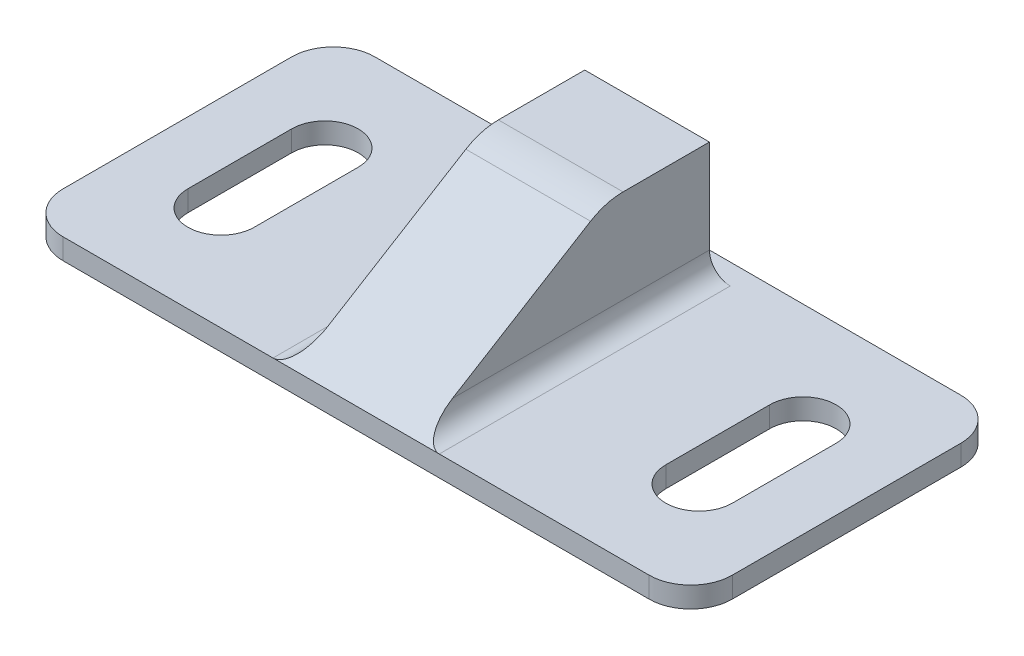
ISO-10303-21;
HEADER;
FILE_DESCRIPTION(('STEP AP214'),'2;1');
FILE_NAME('part.step','',(''),(''),'','','');
FILE_SCHEMA(('AUTOMOTIVE_DESIGN { 1 0 10303 214 1 1 1 1 }'));
ENDSEC;
DATA;
#1=APPLICATION_CONTEXT('core data for automotive mechanical design processes');
#2=APPLICATION_PROTOCOL_DEFINITION('international standard','automotive_design',2000,#1);
#3=PRODUCT_CONTEXT('',#1,'mechanical');
#4=PRODUCT('Part','Part','',(#3));
#5=PRODUCT_RELATED_PRODUCT_CATEGORY('part','',(#4));
#6=PRODUCT_DEFINITION_FORMATION('','',#4);
#7=PRODUCT_DEFINITION_CONTEXT('part definition',#1,'design');
#8=PRODUCT_DEFINITION('design','',#6,#7);
#9=PRODUCT_DEFINITION_SHAPE('','',#8);
#10=(LENGTH_UNIT() NAMED_UNIT(*) SI_UNIT(.MILLI.,.METRE.));
#11=(NAMED_UNIT(*) PLANE_ANGLE_UNIT() SI_UNIT($,.RADIAN.));
#12=(NAMED_UNIT(*) SI_UNIT($,.STERADIAN.) SOLID_ANGLE_UNIT());
#13=UNCERTAINTY_MEASURE_WITH_UNIT(LENGTH_MEASURE(1.E-05),#10,'distance_accuracy_value','');
#14=(GEOMETRIC_REPRESENTATION_CONTEXT(3) GLOBAL_UNCERTAINTY_ASSIGNED_CONTEXT((#13)) GLOBAL_UNIT_ASSIGNED_CONTEXT((#10,
#11,#12)) REPRESENTATION_CONTEXT('',''));
#15=CARTESIAN_POINT('',(0.,0.,0.));
#16=DIRECTION('',(0.,0.,1.));
#17=DIRECTION('',(1.,0.,0.));
#18=AXIS2_PLACEMENT_3D('',#15,#16,#17);
#19=CARTESIAN_POINT('',(-14.1,1.,-5.5));
#20=DIRECTION('',(0.,-1.,0.));
#21=DIRECTION('',(0.,0.,-1.));
#22=AXIS2_PLACEMENT_3D('',#19,#20,#21);
#23=PLANE('',#22);
#24=CARTESIAN_POINT('',(-11.5,1.,2.49999999999999));
#25=DIRECTION('',(0.,1.,0.));
#26=DIRECTION('',(0.,0.,-1.));
#27=AXIS2_PLACEMENT_3D('',#24,#25,#26);
#28=CIRCLE('',#27,1.6);
#29=CARTESIAN_POINT('',(-13.1,1.,2.49999999999999));
#30=VERTEX_POINT('',#29);
#31=CARTESIAN_POINT('',(-9.9,1.,2.49999999999999));
#32=VERTEX_POINT('',#31);
#33=EDGE_CURVE('E231',#30,#32,#28,.T.);
#34=ORIENTED_EDGE('',*,*,#33,.F.);
#35=DIRECTION('',(0.,0.,1.));
#36=VECTOR('',#35,1.);
#37=CARTESIAN_POINT('',(-13.1,1.,2.49999999999999));
#38=LINE('',#37,#36);
#39=CARTESIAN_POINT('',(-13.1,1.,-2.5));
#40=VERTEX_POINT('',#39);
#41=EDGE_CURVE('E239',#40,#30,#38,.T.);
#42=ORIENTED_EDGE('',*,*,#41,.F.);
#43=CARTESIAN_POINT('',(-11.5,1.,-2.5));
#44=DIRECTION('',(0.,1.,0.));
#45=DIRECTION('',(0.,0.,-1.));
#46=AXIS2_PLACEMENT_3D('',#43,#44,#45);
#47=CIRCLE('',#46,1.6);
#48=CARTESIAN_POINT('',(-9.9,1.,-2.5));
#49=VERTEX_POINT('',#48);
#50=EDGE_CURVE('E236',#49,#40,#47,.T.);
#51=ORIENTED_EDGE('',*,*,#50,.F.);
#52=DIRECTION('',(0.,0.,-1.));
#53=VECTOR('',#52,1.);
#54=CARTESIAN_POINT('',(-9.9,1.,2.49999999999999));
#55=LINE('',#54,#53);
#56=EDGE_CURVE('E233',#32,#49,#55,.T.);
#57=ORIENTED_EDGE('',*,*,#56,.F.);
#58=EDGE_LOOP('',(#34,#42,#51,#57));
#59=FACE_BOUND('',#58,.T.);
#60=CARTESIAN_POINT('',(11.5,1.,2.5));
#61=DIRECTION('',(0.,1.,0.));
#62=DIRECTION('',(0.,0.,1.));
#63=AXIS2_PLACEMENT_3D('',#60,#61,#62);
#64=CIRCLE('',#63,1.6);
#65=CARTESIAN_POINT('',(9.9,1.,2.5));
#66=VERTEX_POINT('',#65);
#67=CARTESIAN_POINT('',(13.1,1.,2.5));
#68=VERTEX_POINT('',#67);
#69=EDGE_CURVE('E262',#66,#68,#64,.T.);
#70=ORIENTED_EDGE('',*,*,#69,.F.);
#71=DIRECTION('',(0.,0.,1.));
#72=VECTOR('',#71,1.);
#73=CARTESIAN_POINT('',(9.9,1.,2.5));
#74=LINE('',#73,#72);
#75=CARTESIAN_POINT('',(9.9,1.,-2.5));
#76=VERTEX_POINT('',#75);
#77=EDGE_CURVE('E270',#76,#66,#74,.T.);
#78=ORIENTED_EDGE('',*,*,#77,.F.);
#79=CARTESIAN_POINT('',(11.5,1.,-2.5));
#80=DIRECTION('',(0.,1.,0.));
#81=DIRECTION('',(0.,0.,1.));
#82=AXIS2_PLACEMENT_3D('',#79,#80,#81);
#83=CIRCLE('',#82,1.6);
#84=CARTESIAN_POINT('',(13.1,1.,-2.5));
#85=VERTEX_POINT('',#84);
#86=EDGE_CURVE('E267',#85,#76,#83,.T.);
#87=ORIENTED_EDGE('',*,*,#86,.F.);
#88=DIRECTION('',(0.,0.,-1.));
#89=VECTOR('',#88,1.);
#90=CARTESIAN_POINT('',(13.1,1.,2.5));
#91=LINE('',#90,#89);
#92=EDGE_CURVE('E264',#68,#85,#91,.T.);
#93=ORIENTED_EDGE('',*,*,#92,.F.);
#94=EDGE_LOOP('',(#70,#78,#87,#93));
#95=FACE_BOUND('',#94,.T.);
#96=DIRECTION('',(1.,0.,0.));
#97=VECTOR('',#96,1.);
#98=CARTESIAN_POINT('',(-14.1,1.,7.5));
#99=LINE('',#98,#97);
#100=CARTESIAN_POINT('',(-14.1,1.,7.5));
#101=VERTEX_POINT('',#100);
#102=CARTESIAN_POINT('',(-4.,1.,7.5));
#103=VERTEX_POINT('',#102);
#104=EDGE_CURVE('E302',#101,#103,#99,.T.);
#105=ORIENTED_EDGE('',*,*,#104,.T.);
#106=DIRECTION('',(0.,0.,-1.));
#107=VECTOR('',#106,1.);
#108=CARTESIAN_POINT('',(-4.,1.,-6.5));
#109=LINE('',#108,#107);
#110=CARTESIAN_POINT('',(-4.,1.,-6.5));
#111=VERTEX_POINT('',#110);
#112=EDGE_CURVE('E354',#103,#111,#109,.T.);
#113=ORIENTED_EDGE('',*,*,#112,.T.);
#114=DIRECTION('',(1.,0.,0.));
#115=VECTOR('',#114,1.);
#116=CARTESIAN_POINT('',(-3.,1.,-6.5));
#117=LINE('',#116,#115);
#118=CARTESIAN_POINT('',(4.,1.,-6.5));
#119=VERTEX_POINT('',#118);
#120=EDGE_CURVE('E208',#111,#119,#117,.T.);
#121=ORIENTED_EDGE('',*,*,#120,.T.);
#122=DIRECTION('',(0.,0.,-1.));
#123=VECTOR('',#122,1.);
#124=CARTESIAN_POINT('',(4.,1.,-5.5));
#125=LINE('',#124,#123);
#126=CARTESIAN_POINT('',(4.,1.,7.5));
#127=VERTEX_POINT('',#126);
#128=EDGE_CURVE('E351',#119,#127,#125,.F.);
#129=ORIENTED_EDGE('',*,*,#128,.T.);
#130=CARTESIAN_POINT('',(14.1,1.,7.5));
#131=VERTEX_POINT('',#130);
#132=EDGE_CURVE('E301',#127,#131,#99,.T.);
#133=ORIENTED_EDGE('',*,*,#132,.T.);
#134=CARTESIAN_POINT('',(14.1,1.,5.5));
#135=DIRECTION('',(0.,1.,0.));
#136=DIRECTION('',(0.,0.,1.));
#137=AXIS2_PLACEMENT_3D('',#134,#135,#136);
#138=CIRCLE('',#137,2.);
#139=CARTESIAN_POINT('',(16.1,1.,5.5));
#140=VERTEX_POINT('',#139);
#141=EDGE_CURVE('E304',#131,#140,#138,.T.);
#142=ORIENTED_EDGE('',*,*,#141,.T.);
#143=DIRECTION('',(0.,0.,-1.));
#144=VECTOR('',#143,1.);
#145=CARTESIAN_POINT('',(16.1,1.,5.5));
#146=LINE('',#145,#144);
#147=CARTESIAN_POINT('',(16.1,1.,-5.5));
#148=VERTEX_POINT('',#147);
#149=EDGE_CURVE('E306',#140,#148,#146,.T.);
#150=ORIENTED_EDGE('',*,*,#149,.T.);
#151=CARTESIAN_POINT('',(14.1,1.,-5.5));
#152=DIRECTION('',(0.,1.,0.));
#153=DIRECTION('',(0.,0.,-1.));
#154=AXIS2_PLACEMENT_3D('',#151,#152,#153);
#155=CIRCLE('',#154,2.);
#156=CARTESIAN_POINT('',(14.1,1.,-7.5));
#157=VERTEX_POINT('',#156);
#158=EDGE_CURVE('E308',#148,#157,#155,.T.);
#159=ORIENTED_EDGE('',*,*,#158,.T.);
#160=DIRECTION('',(-1.,0.,0.));
#161=VECTOR('',#160,1.);
#162=CARTESIAN_POINT('',(-14.1,1.,-7.5));
#163=LINE('',#162,#161);
#164=CARTESIAN_POINT('',(-14.1,1.,-7.5));
#165=VERTEX_POINT('',#164);
#166=EDGE_CURVE('E310',#157,#165,#163,.T.);
#167=ORIENTED_EDGE('',*,*,#166,.T.);
#168=CARTESIAN_POINT('',(-14.1,1.,-5.5));
#169=DIRECTION('',(0.,1.,0.));
#170=DIRECTION('',(0.,0.,-1.));
#171=AXIS2_PLACEMENT_3D('',#168,#169,#170);
#172=CIRCLE('',#171,2.);
#173=CARTESIAN_POINT('',(-16.1,1.,-5.5));
#174=VERTEX_POINT('',#173);
#175=EDGE_CURVE('E293',#165,#174,#172,.T.);
#176=ORIENTED_EDGE('',*,*,#175,.T.);
#177=DIRECTION('',(0.,0.,1.));
#178=VECTOR('',#177,1.);
#179=CARTESIAN_POINT('',(-16.1,1.,5.5));
#180=LINE('',#179,#178);
#181=CARTESIAN_POINT('',(-16.1,1.,5.5));
#182=VERTEX_POINT('',#181);
#183=EDGE_CURVE('E296',#174,#182,#180,.T.);
#184=ORIENTED_EDGE('',*,*,#183,.T.);
#185=CARTESIAN_POINT('',(-14.1,1.,5.5));
#186=DIRECTION('',(0.,1.,0.));
#187=DIRECTION('',(0.,0.,-1.));
#188=AXIS2_PLACEMENT_3D('',#185,#186,#187);
#189=CIRCLE('',#188,2.);
#190=EDGE_CURVE('E299',#182,#101,#189,.T.);
#191=ORIENTED_EDGE('',*,*,#190,.T.);
#192=EDGE_LOOP('',(#105,#113,#121,#129,#133,#142,#150,#159,#167,#176,#184,#191));
#193=FACE_BOUND('',#192,.T.);
#194=ADVANCED_FACE('F33',(#59,#95,#193),#23,.F.);
#195=CARTESIAN_POINT('',(-14.1,0.,-5.5));
#196=DIRECTION('',(0.,-1.,0.));
#197=DIRECTION('',(0.,0.,-1.));
#198=AXIS2_PLACEMENT_3D('',#195,#196,#197);
#199=PLANE('',#198);
#200=CARTESIAN_POINT('',(-14.1,0.,-5.5));
#201=DIRECTION('',(0.,1.,0.));
#202=DIRECTION('',(0.,0.,-1.));
#203=AXIS2_PLACEMENT_3D('',#200,#201,#202);
#204=CIRCLE('',#203,2.);
#205=CARTESIAN_POINT('',(-14.1,0.,-7.5));
#206=VERTEX_POINT('',#205);
#207=CARTESIAN_POINT('',(-16.1,0.,-5.5));
#208=VERTEX_POINT('',#207);
#209=EDGE_CURVE('E292',#206,#208,#204,.T.);
#210=ORIENTED_EDGE('',*,*,#209,.F.);
#211=DIRECTION('',(-1.,0.,0.));
#212=VECTOR('',#211,1.);
#213=CARTESIAN_POINT('',(-14.1,0.,-7.5));
#214=LINE('',#213,#212);
#215=CARTESIAN_POINT('',(14.1,0.,-7.5));
#216=VERTEX_POINT('',#215);
#217=EDGE_CURVE('E297',#216,#206,#214,.T.);
#218=ORIENTED_EDGE('',*,*,#217,.F.);
#219=CARTESIAN_POINT('',(14.1,0.,-5.5));
#220=DIRECTION('',(0.,1.,0.));
#221=DIRECTION('',(0.,0.,-1.));
#222=AXIS2_PLACEMENT_3D('',#219,#220,#221);
#223=CIRCLE('',#222,2.);
#224=CARTESIAN_POINT('',(16.1,0.,-5.5));
#225=VERTEX_POINT('',#224);
#226=EDGE_CURVE('E325',#225,#216,#223,.T.);
#227=ORIENTED_EDGE('',*,*,#226,.F.);
#228=DIRECTION('',(0.,0.,-1.));
#229=VECTOR('',#228,1.);
#230=CARTESIAN_POINT('',(16.1,0.,5.5));
#231=LINE('',#230,#229);
#232=CARTESIAN_POINT('',(16.1,0.,5.5));
#233=VERTEX_POINT('',#232);
#234=EDGE_CURVE('E323',#233,#225,#231,.T.);
#235=ORIENTED_EDGE('',*,*,#234,.F.);
#236=CARTESIAN_POINT('',(14.1,0.,5.5));
#237=DIRECTION('',(0.,1.,0.));
#238=DIRECTION('',(0.,0.,1.));
#239=AXIS2_PLACEMENT_3D('',#236,#237,#238);
#240=CIRCLE('',#239,2.);
#241=CARTESIAN_POINT('',(14.1,0.,7.5));
#242=VERTEX_POINT('',#241);
#243=EDGE_CURVE('E321',#242,#233,#240,.T.);
#244=ORIENTED_EDGE('',*,*,#243,.F.);
#245=DIRECTION('',(1.,0.,0.));
#246=VECTOR('',#245,1.);
#247=CARTESIAN_POINT('',(-14.1,0.,7.5));
#248=LINE('',#247,#246);
#249=CARTESIAN_POINT('',(-14.1,0.,7.5));
#250=VERTEX_POINT('',#249);
#251=EDGE_CURVE('E319',#250,#242,#248,.T.);
#252=ORIENTED_EDGE('',*,*,#251,.F.);
#253=CARTESIAN_POINT('',(-14.1,0.,5.5));
#254=DIRECTION('',(0.,1.,0.));
#255=DIRECTION('',(0.,0.,-1.));
#256=AXIS2_PLACEMENT_3D('',#253,#254,#255);
#257=CIRCLE('',#256,2.);
#258=CARTESIAN_POINT('',(-16.1,0.,5.5));
#259=VERTEX_POINT('',#258);
#260=EDGE_CURVE('E317',#259,#250,#257,.T.);
#261=ORIENTED_EDGE('',*,*,#260,.F.);
#262=DIRECTION('',(0.,0.,1.));
#263=VECTOR('',#262,1.);
#264=CARTESIAN_POINT('',(-16.1,0.,5.5));
#265=LINE('',#264,#263);
#266=EDGE_CURVE('E315',#208,#259,#265,.T.);
#267=ORIENTED_EDGE('',*,*,#266,.F.);
#268=EDGE_LOOP('',(#210,#218,#227,#235,#244,#252,#261,#267));
#269=FACE_BOUND('',#268,.T.);
#270=DIRECTION('',(0.,0.,1.));
#271=VECTOR('',#270,1.);
#272=CARTESIAN_POINT('',(9.9,0.,2.5));
#273=LINE('',#272,#271);
#274=CARTESIAN_POINT('',(9.9,0.,-2.5));
#275=VERTEX_POINT('',#274);
#276=CARTESIAN_POINT('',(9.9,0.,2.5));
#277=VERTEX_POINT('',#276);
#278=EDGE_CURVE('E265',#275,#277,#273,.T.);
#279=ORIENTED_EDGE('',*,*,#278,.T.);
#280=CARTESIAN_POINT('',(11.5,0.,2.5));
#281=DIRECTION('',(0.,1.,0.));
#282=DIRECTION('',(0.,0.,1.));
#283=AXIS2_PLACEMENT_3D('',#280,#281,#282);
#284=CIRCLE('',#283,1.6);
#285=CARTESIAN_POINT('',(13.1,0.,2.5));
#286=VERTEX_POINT('',#285);
#287=EDGE_CURVE('E261',#277,#286,#284,.T.);
#288=ORIENTED_EDGE('',*,*,#287,.T.);
#289=DIRECTION('',(0.,0.,-1.));
#290=VECTOR('',#289,1.);
#291=CARTESIAN_POINT('',(13.1,0.,2.5));
#292=LINE('',#291,#290);
#293=CARTESIAN_POINT('',(13.1,0.,-2.5));
#294=VERTEX_POINT('',#293);
#295=EDGE_CURVE('E275',#286,#294,#292,.T.);
#296=ORIENTED_EDGE('',*,*,#295,.T.);
#297=CARTESIAN_POINT('',(11.5,0.,-2.5));
#298=DIRECTION('',(0.,1.,0.));
#299=DIRECTION('',(0.,0.,1.));
#300=AXIS2_PLACEMENT_3D('',#297,#298,#299);
#301=CIRCLE('',#300,1.6);
#302=EDGE_CURVE('E278',#294,#275,#301,.T.);
#303=ORIENTED_EDGE('',*,*,#302,.T.);
#304=EDGE_LOOP('',(#279,#288,#296,#303));
#305=FACE_BOUND('',#304,.T.);
#306=DIRECTION('',(0.,0.,1.));
#307=VECTOR('',#306,1.);
#308=CARTESIAN_POINT('',(-13.1,0.,2.49999999999999));
#309=LINE('',#308,#307);
#310=CARTESIAN_POINT('',(-13.1,0.,-2.5));
#311=VERTEX_POINT('',#310);
#312=CARTESIAN_POINT('',(-13.1,0.,2.49999999999999));
#313=VERTEX_POINT('',#312);
#314=EDGE_CURVE('E234',#311,#313,#309,.T.);
#315=ORIENTED_EDGE('',*,*,#314,.T.);
#316=CARTESIAN_POINT('',(-11.5,0.,2.49999999999999));
#317=DIRECTION('',(0.,1.,0.));
#318=DIRECTION('',(0.,0.,-1.));
#319=AXIS2_PLACEMENT_3D('',#316,#317,#318);
#320=CIRCLE('',#319,1.6);
#321=CARTESIAN_POINT('',(-9.9,0.,2.49999999999999));
#322=VERTEX_POINT('',#321);
#323=EDGE_CURVE('E227',#313,#322,#320,.T.);
#324=ORIENTED_EDGE('',*,*,#323,.T.);
#325=DIRECTION('',(0.,0.,-1.));
#326=VECTOR('',#325,1.);
#327=CARTESIAN_POINT('',(-9.9,0.,2.49999999999999));
#328=LINE('',#327,#326);
#329=CARTESIAN_POINT('',(-9.9,0.,-2.5));
#330=VERTEX_POINT('',#329);
#331=EDGE_CURVE('E244',#322,#330,#328,.T.);
#332=ORIENTED_EDGE('',*,*,#331,.T.);
#333=CARTESIAN_POINT('',(-11.5,0.,-2.5));
#334=DIRECTION('',(0.,1.,0.));
#335=DIRECTION('',(0.,0.,-1.));
#336=AXIS2_PLACEMENT_3D('',#333,#334,#335);
#337=CIRCLE('',#336,1.6);
#338=EDGE_CURVE('E247',#330,#311,#337,.T.);
#339=ORIENTED_EDGE('',*,*,#338,.T.);
#340=EDGE_LOOP('',(#315,#324,#332,#339));
#341=FACE_BOUND('',#340,.T.);
#342=ADVANCED_FACE('F430',(#269,#305,#341),#199,.T.);
#343=CARTESIAN_POINT('',(-14.1,1.,-5.5));
#344=DIRECTION('',(0.,-1.,0.));
#345=DIRECTION('',(0.,0.,-1.));
#346=AXIS2_PLACEMENT_3D('',#343,#344,#345);
#347=CYLINDRICAL_SURFACE('',#346,2.);
#348=ORIENTED_EDGE('',*,*,#209,.T.);
#349=DIRECTION('',(0.,-1.,0.));
#350=VECTOR('',#349,1.);
#351=CARTESIAN_POINT('',(-16.1,1.,-5.5));
#352=LINE('',#351,#350);
#353=EDGE_CURVE('E348',#174,#208,#352,.T.);
#354=ORIENTED_EDGE('',*,*,#353,.F.);
#355=ORIENTED_EDGE('',*,*,#175,.F.);
#356=DIRECTION('',(0.,-1.,0.));
#357=VECTOR('',#356,1.);
#358=CARTESIAN_POINT('',(-14.1,1.,-7.5));
#359=LINE('',#358,#357);
#360=EDGE_CURVE('E312',#165,#206,#359,.T.);
#361=ORIENTED_EDGE('',*,*,#360,.T.);
#362=EDGE_LOOP('',(#348,#354,#355,#361));
#363=FACE_BOUND('',#362,.T.);
#364=ADVANCED_FACE('F396',(#363),#347,.T.);
#365=CARTESIAN_POINT('',(-16.1,1.,5.5));
#366=DIRECTION('',(1.,0.,0.));
#367=DIRECTION('',(0.,0.,-1.));
#368=AXIS2_PLACEMENT_3D('',#365,#366,#367);
#369=PLANE('',#368);
#370=ORIENTED_EDGE('',*,*,#266,.T.);
#371=DIRECTION('',(0.,-1.,0.));
#372=VECTOR('',#371,1.);
#373=CARTESIAN_POINT('',(-16.1,1.,5.5));
#374=LINE('',#373,#372);
#375=EDGE_CURVE('E345',#182,#259,#374,.T.);
#376=ORIENTED_EDGE('',*,*,#375,.F.);
#377=ORIENTED_EDGE('',*,*,#183,.F.);
#378=ORIENTED_EDGE('',*,*,#353,.T.);
#379=EDGE_LOOP('',(#370,#376,#377,#378));
#380=FACE_BOUND('',#379,.T.);
#381=ADVANCED_FACE('F399',(#380),#369,.F.);
#382=CARTESIAN_POINT('',(-14.1,1.,5.5));
#383=DIRECTION('',(0.,-1.,0.));
#384=DIRECTION('',(0.,0.,-1.));
#385=AXIS2_PLACEMENT_3D('',#382,#383,#384);
#386=CYLINDRICAL_SURFACE('',#385,2.);
#387=ORIENTED_EDGE('',*,*,#260,.T.);
#388=DIRECTION('',(0.,-1.,0.));
#389=VECTOR('',#388,1.);
#390=CARTESIAN_POINT('',(-14.1,1.,7.5));
#391=LINE('',#390,#389);
#392=EDGE_CURVE('E342',#101,#250,#391,.T.);
#393=ORIENTED_EDGE('',*,*,#392,.F.);
#394=ORIENTED_EDGE('',*,*,#190,.F.);
#395=ORIENTED_EDGE('',*,*,#375,.T.);
#396=EDGE_LOOP('',(#387,#393,#394,#395));
#397=FACE_BOUND('',#396,.T.);
#398=ADVANCED_FACE('F404',(#397),#386,.T.);
#399=CARTESIAN_POINT('',(-14.1,1.,7.5));
#400=DIRECTION('',(0.,0.,-1.));
#401=DIRECTION('',(-1.,0.,0.));
#402=AXIS2_PLACEMENT_3D('',#399,#400,#401);
#403=PLANE('',#402);
#404=ORIENTED_EDGE('',*,*,#251,.T.);
#405=DIRECTION('',(0.,-1.,0.));
#406=VECTOR('',#405,1.);
#407=CARTESIAN_POINT('',(14.1,1.,7.5));
#408=LINE('',#407,#406);
#409=EDGE_CURVE('E339',#131,#242,#408,.T.);
#410=ORIENTED_EDGE('',*,*,#409,.F.);
#411=ORIENTED_EDGE('',*,*,#132,.F.);
#412=DIRECTION('',(1.,0.,0.));
#413=VECTOR('',#412,1.);
#414=CARTESIAN_POINT('',(-3.,1.,7.5));
#415=LINE('',#414,#413);
#416=EDGE_CURVE('E49',#103,#127,#415,.T.);
#417=ORIENTED_EDGE('',*,*,#416,.F.);
#418=ORIENTED_EDGE('',*,*,#104,.F.);
#419=ORIENTED_EDGE('',*,*,#392,.T.);
#420=EDGE_LOOP('',(#404,#410,#411,#417,#418,#419));
#421=FACE_BOUND('',#420,.T.);
#422=ADVANCED_FACE('F370',(#421),#403,.F.);
#423=CARTESIAN_POINT('',(14.1,1.,5.5));
#424=DIRECTION('',(0.,-1.,0.));
#425=DIRECTION('',(0.,0.,-1.));
#426=AXIS2_PLACEMENT_3D('',#423,#424,#425);
#427=CYLINDRICAL_SURFACE('',#426,2.);
#428=ORIENTED_EDGE('',*,*,#243,.T.);
#429=DIRECTION('',(0.,-1.,0.));
#430=VECTOR('',#429,1.);
#431=CARTESIAN_POINT('',(16.1,1.,5.5));
#432=LINE('',#431,#430);
#433=EDGE_CURVE('E336',#140,#233,#432,.T.);
#434=ORIENTED_EDGE('',*,*,#433,.F.);
#435=ORIENTED_EDGE('',*,*,#141,.F.);
#436=ORIENTED_EDGE('',*,*,#409,.T.);
#437=EDGE_LOOP('',(#428,#434,#435,#436));
#438=FACE_BOUND('',#437,.T.);
#439=ADVANCED_FACE('F376',(#438),#427,.T.);
#440=CARTESIAN_POINT('',(16.1,1.,5.5));
#441=DIRECTION('',(-1.,0.,0.));
#442=DIRECTION('',(0.,0.,1.));
#443=AXIS2_PLACEMENT_3D('',#440,#441,#442);
#444=PLANE('',#443);
#445=ORIENTED_EDGE('',*,*,#234,.T.);
#446=DIRECTION('',(0.,-1.,0.));
#447=VECTOR('',#446,1.);
#448=CARTESIAN_POINT('',(16.1,1.,-5.5));
#449=LINE('',#448,#447);
#450=EDGE_CURVE('E333',#148,#225,#449,.T.);
#451=ORIENTED_EDGE('',*,*,#450,.F.);
#452=ORIENTED_EDGE('',*,*,#149,.F.);
#453=ORIENTED_EDGE('',*,*,#433,.T.);
#454=EDGE_LOOP('',(#445,#451,#452,#453));
#455=FACE_BOUND('',#454,.T.);
#456=ADVANCED_FACE('F382',(#455),#444,.F.);
#457=CARTESIAN_POINT('',(14.1,1.,-5.5));
#458=DIRECTION('',(0.,-1.,0.));
#459=DIRECTION('',(0.,0.,-1.));
#460=AXIS2_PLACEMENT_3D('',#457,#458,#459);
#461=CYLINDRICAL_SURFACE('',#460,2.);
#462=ORIENTED_EDGE('',*,*,#226,.T.);
#463=DIRECTION('',(0.,-1.,0.));
#464=VECTOR('',#463,1.);
#465=CARTESIAN_POINT('',(14.1,1.,-7.5));
#466=LINE('',#465,#464);
#467=EDGE_CURVE('E330',#157,#216,#466,.T.);
#468=ORIENTED_EDGE('',*,*,#467,.F.);
#469=ORIENTED_EDGE('',*,*,#158,.F.);
#470=ORIENTED_EDGE('',*,*,#450,.T.);
#471=EDGE_LOOP('',(#462,#468,#469,#470));
#472=FACE_BOUND('',#471,.T.);
#473=ADVANCED_FACE('F386',(#472),#461,.T.);
#474=CARTESIAN_POINT('',(-14.1,1.,-7.5));
#475=DIRECTION('',(0.,0.,1.));
#476=DIRECTION('',(1.,0.,0.));
#477=AXIS2_PLACEMENT_3D('',#474,#475,#476);
#478=PLANE('',#477);
#479=ORIENTED_EDGE('',*,*,#217,.T.);
#480=ORIENTED_EDGE('',*,*,#360,.F.);
#481=ORIENTED_EDGE('',*,*,#166,.F.);
#482=ORIENTED_EDGE('',*,*,#467,.T.);
#483=EDGE_LOOP('',(#479,#480,#481,#482));
#484=FACE_BOUND('',#483,.T.);
#485=ADVANCED_FACE('F391',(#484),#478,.F.);
#486=CARTESIAN_POINT('',(11.5,1.,2.5));
#487=DIRECTION('',(0.,-1.,0.));
#488=DIRECTION('',(0.,0.,-1.));
#489=AXIS2_PLACEMENT_3D('',#486,#487,#488);
#490=CYLINDRICAL_SURFACE('',#489,1.6);
#491=ORIENTED_EDGE('',*,*,#287,.F.);
#492=DIRECTION('',(0.,-1.,0.));
#493=VECTOR('',#492,1.);
#494=CARTESIAN_POINT('',(9.9,1.,2.5));
#495=LINE('',#494,#493);
#496=EDGE_CURVE('E272',#66,#277,#495,.T.);
#497=ORIENTED_EDGE('',*,*,#496,.F.);
#498=ORIENTED_EDGE('',*,*,#69,.T.);
#499=DIRECTION('',(0.,-1.,0.));
#500=VECTOR('',#499,1.);
#501=CARTESIAN_POINT('',(13.1,1.,2.5));
#502=LINE('',#501,#500);
#503=EDGE_CURVE('E289',#68,#286,#502,.T.);
#504=ORIENTED_EDGE('',*,*,#503,.T.);
#505=EDGE_LOOP('',(#491,#497,#498,#504));
#506=FACE_BOUND('',#505,.T.);
#507=ADVANCED_FACE('F441',(#506),#490,.F.);
#508=CARTESIAN_POINT('',(13.1,1.,2.5));
#509=DIRECTION('',(-1.,0.,0.));
#510=DIRECTION('',(0.,0.,1.));
#511=AXIS2_PLACEMENT_3D('',#508,#509,#510);
#512=PLANE('',#511);
#513=ORIENTED_EDGE('',*,*,#295,.F.);
#514=ORIENTED_EDGE('',*,*,#503,.F.);
#515=ORIENTED_EDGE('',*,*,#92,.T.);
#516=DIRECTION('',(0.,-1.,0.));
#517=VECTOR('',#516,1.);
#518=CARTESIAN_POINT('',(13.1,1.,-2.5));
#519=LINE('',#518,#517);
#520=EDGE_CURVE('E287',#85,#294,#519,.T.);
#521=ORIENTED_EDGE('',*,*,#520,.T.);
#522=EDGE_LOOP('',(#513,#514,#515,#521));
#523=FACE_BOUND('',#522,.T.);
#524=ADVANCED_FACE('F496',(#523),#512,.T.);
#525=CARTESIAN_POINT('',(11.5,1.,-2.5));
#526=DIRECTION('',(0.,-1.,0.));
#527=DIRECTION('',(0.,0.,-1.));
#528=AXIS2_PLACEMENT_3D('',#525,#526,#527);
#529=CYLINDRICAL_SURFACE('',#528,1.6);
#530=ORIENTED_EDGE('',*,*,#302,.F.);
#531=ORIENTED_EDGE('',*,*,#520,.F.);
#532=ORIENTED_EDGE('',*,*,#86,.T.);
#533=DIRECTION('',(0.,-1.,0.));
#534=VECTOR('',#533,1.);
#535=CARTESIAN_POINT('',(9.9,1.,-2.5));
#536=LINE('',#535,#534);
#537=EDGE_CURVE('E285',#76,#275,#536,.T.);
#538=ORIENTED_EDGE('',*,*,#537,.T.);
#539=EDGE_LOOP('',(#530,#531,#532,#538));
#540=FACE_BOUND('',#539,.T.);
#541=ADVANCED_FACE('F493',(#540),#529,.F.);
#542=CARTESIAN_POINT('',(9.9,1.,2.5));
#543=DIRECTION('',(1.,0.,0.));
#544=DIRECTION('',(0.,0.,-1.));
#545=AXIS2_PLACEMENT_3D('',#542,#543,#544);
#546=PLANE('',#545);
#547=ORIENTED_EDGE('',*,*,#278,.F.);
#548=ORIENTED_EDGE('',*,*,#537,.F.);
#549=ORIENTED_EDGE('',*,*,#77,.T.);
#550=ORIENTED_EDGE('',*,*,#496,.T.);
#551=EDGE_LOOP('',(#547,#548,#549,#550));
#552=FACE_BOUND('',#551,.T.);
#553=ADVANCED_FACE('F489',(#552),#546,.T.);
#554=CARTESIAN_POINT('',(-11.5,1.,2.49999999999999));
#555=DIRECTION('',(0.,-1.,0.));
#556=DIRECTION('',(0.,0.,-1.));
#557=AXIS2_PLACEMENT_3D('',#554,#555,#556);
#558=CYLINDRICAL_SURFACE('',#557,1.6);
#559=ORIENTED_EDGE('',*,*,#323,.F.);
#560=DIRECTION('',(0.,-1.,0.));
#561=VECTOR('',#560,1.);
#562=CARTESIAN_POINT('',(-13.1,1.,2.49999999999999));
#563=LINE('',#562,#561);
#564=EDGE_CURVE('E241',#30,#313,#563,.T.);
#565=ORIENTED_EDGE('',*,*,#564,.F.);
#566=ORIENTED_EDGE('',*,*,#33,.T.);
#567=DIRECTION('',(0.,-1.,0.));
#568=VECTOR('',#567,1.);
#569=CARTESIAN_POINT('',(-9.9,1.,2.49999999999999));
#570=LINE('',#569,#568);
#571=EDGE_CURVE('E258',#32,#322,#570,.T.);
#572=ORIENTED_EDGE('',*,*,#571,.T.);
#573=EDGE_LOOP('',(#559,#565,#566,#572));
#574=FACE_BOUND('',#573,.T.);
#575=ADVANCED_FACE('F485',(#574),#558,.F.);
#576=CARTESIAN_POINT('',(-9.9,1.,2.49999999999999));
#577=DIRECTION('',(-1.,0.,0.));
#578=DIRECTION('',(0.,0.,1.));
#579=AXIS2_PLACEMENT_3D('',#576,#577,#578);
#580=PLANE('',#579);
#581=ORIENTED_EDGE('',*,*,#331,.F.);
#582=ORIENTED_EDGE('',*,*,#571,.F.);
#583=ORIENTED_EDGE('',*,*,#56,.T.);
#584=DIRECTION('',(0.,-1.,0.));
#585=VECTOR('',#584,1.);
#586=CARTESIAN_POINT('',(-9.9,1.,-2.5));
#587=LINE('',#586,#585);
#588=EDGE_CURVE('E256',#49,#330,#587,.T.);
#589=ORIENTED_EDGE('',*,*,#588,.T.);
#590=EDGE_LOOP('',(#581,#582,#583,#589));
#591=FACE_BOUND('',#590,.T.);
#592=ADVANCED_FACE('F481',(#591),#580,.T.);
#593=CARTESIAN_POINT('',(-11.5,1.,-2.5));
#594=DIRECTION('',(0.,-1.,0.));
#595=DIRECTION('',(0.,0.,-1.));
#596=AXIS2_PLACEMENT_3D('',#593,#594,#595);
#597=CYLINDRICAL_SURFACE('',#596,1.6);
#598=ORIENTED_EDGE('',*,*,#338,.F.);
#599=ORIENTED_EDGE('',*,*,#588,.F.);
#600=ORIENTED_EDGE('',*,*,#50,.T.);
#601=DIRECTION('',(0.,-1.,0.));
#602=VECTOR('',#601,1.);
#603=CARTESIAN_POINT('',(-13.1,1.,-2.5));
#604=LINE('',#603,#602);
#605=EDGE_CURVE('E254',#40,#311,#604,.T.);
#606=ORIENTED_EDGE('',*,*,#605,.T.);
#607=EDGE_LOOP('',(#598,#599,#600,#606));
#608=FACE_BOUND('',#607,.T.);
#609=ADVANCED_FACE('F477',(#608),#597,.F.);
#610=CARTESIAN_POINT('',(-13.1,1.,2.49999999999999));
#611=DIRECTION('',(1.,0.,0.));
#612=DIRECTION('',(0.,0.,-1.));
#613=AXIS2_PLACEMENT_3D('',#610,#611,#612);
#614=PLANE('',#613);
#615=ORIENTED_EDGE('',*,*,#314,.F.);
#616=ORIENTED_EDGE('',*,*,#605,.F.);
#617=ORIENTED_EDGE('',*,*,#41,.T.);
#618=ORIENTED_EDGE('',*,*,#564,.T.);
#619=EDGE_LOOP('',(#615,#616,#617,#618));
#620=FACE_BOUND('',#619,.T.);
#621=ADVANCED_FACE('F426',(#620),#614,.T.);
#622=CARTESIAN_POINT('',(-3.,6.05984550095588,-0.779747183382345));
#623=DIRECTION('',(0.,0.853281833651959,0.521450009453975));
#624=DIRECTION('',(0.,-0.521450009453975,0.853281833651959));
#625=AXIS2_PLACEMENT_3D('',#622,#623,#624);
#626=PLANE('',#625);
#627=ORIENTED_EDGE('',*,*,#416,.T.);
#628=CARTESIAN_POINT('',(4.,2.,5.86363636363636));
#629=DIRECTION('',(0.,0.853281833651959,0.521450009453975));
#630=DIRECTION('',(0.,0.521450009453975,-0.853281833651959));
#631=AXIS2_PLACEMENT_3D('',#628,#629,#630);
#632=ELLIPSE('',#631,1.91772937361173,1.);
#633=CARTESIAN_POINT('',(3.,2.,5.86363636363636));
#634=VERTEX_POINT('',#633);
#635=EDGE_CURVE('E11',#127,#634,#632,.F.);
#636=ORIENTED_EDGE('',*,*,#635,.T.);
#637=DIRECTION('',(0.,-0.521450009453975,0.853281833651959));
#638=VECTOR('',#637,1.);
#639=CARTESIAN_POINT('',(3.,6.05984550095588,-0.779747183382345));
#640=LINE('',#639,#638);
#641=CARTESIAN_POINT('',(3.,6.05984550095588,-0.779747183382345));
#642=VERTEX_POINT('',#641);
#643=EDGE_CURVE('E197',#642,#634,#640,.T.);
#644=ORIENTED_EDGE('',*,*,#643,.F.);
#645=DIRECTION('',(1.,0.,0.));
#646=VECTOR('',#645,1.);
#647=CARTESIAN_POINT('',(-3.,6.05984550095588,-0.779747183382345));
#648=LINE('',#647,#646);
#649=CARTESIAN_POINT('',(-3.,6.05984550095588,-0.779747183382345));
#650=VERTEX_POINT('',#649);
#651=EDGE_CURVE('E225',#650,#642,#648,.T.);
#652=ORIENTED_EDGE('',*,*,#651,.F.);
#653=DIRECTION('',(0.,-0.521450009453975,0.853281833651959));
#654=VECTOR('',#653,1.);
#655=CARTESIAN_POINT('',(-3.,6.05984550095588,-0.779747183382345));
#656=LINE('',#655,#654);
#657=CARTESIAN_POINT('',(-3.,2.,5.86363636363636));
#658=VERTEX_POINT('',#657);
#659=EDGE_CURVE('E213',#650,#658,#656,.T.);
#660=ORIENTED_EDGE('',*,*,#659,.T.);
#661=CARTESIAN_POINT('',(-4.,2.,5.86363636363636));
#662=DIRECTION('',(0.,0.853281833651959,0.521450009453975));
#663=DIRECTION('',(0.,-0.521450009453975,0.853281833651959));
#664=AXIS2_PLACEMENT_3D('',#661,#662,#663);
#665=ELLIPSE('',#664,1.91772937361173,1.);
#666=EDGE_CURVE('E362',#658,#103,#665,.F.);
#667=ORIENTED_EDGE('',*,*,#666,.T.);
#668=EDGE_LOOP('',(#627,#636,#644,#652,#660,#667));
#669=FACE_BOUND('',#668,.T.);
#670=ADVANCED_FACE('F408',(#669),#626,.T.);
#671=CARTESIAN_POINT('',(-3.,3.5,-2.34409721174427));
#672=DIRECTION('',(1.,0.,0.));
#673=DIRECTION('',(0.,0.,-1.));
#674=AXIS2_PLACEMENT_3D('',#671,#672,#673);
#675=CYLINDRICAL_SURFACE('',#674,3.);
#676=ORIENTED_EDGE('',*,*,#651,.T.);
#677=CARTESIAN_POINT('',(3.,3.5,-2.34409721174427));
#678=DIRECTION('',(1.,0.,0.));
#679=DIRECTION('',(0.,0.,-1.));
#680=AXIS2_PLACEMENT_3D('',#677,#678,#679);
#681=CIRCLE('',#680,3.);
#682=CARTESIAN_POINT('',(3.,6.5,-2.34409721174427));
#683=VERTEX_POINT('',#682);
#684=EDGE_CURVE('E211',#683,#642,#681,.T.);
#685=ORIENTED_EDGE('',*,*,#684,.F.);
#686=DIRECTION('',(1.,0.,0.));
#687=VECTOR('',#686,1.);
#688=CARTESIAN_POINT('',(-3.,6.5,-2.34409721174427));
#689=LINE('',#688,#687);
#690=CARTESIAN_POINT('',(-3.,6.5,-2.34409721174427));
#691=VERTEX_POINT('',#690);
#692=EDGE_CURVE('E207',#691,#683,#689,.T.);
#693=ORIENTED_EDGE('',*,*,#692,.F.);
#694=CARTESIAN_POINT('',(-3.,3.5,-2.34409721174427));
#695=DIRECTION('',(1.,0.,0.));
#696=DIRECTION('',(0.,0.,-1.));
#697=AXIS2_PLACEMENT_3D('',#694,#695,#696);
#698=CIRCLE('',#697,3.);
#699=EDGE_CURVE('E222',#691,#650,#698,.T.);
#700=ORIENTED_EDGE('',*,*,#699,.T.);
#701=EDGE_LOOP('',(#676,#685,#693,#700));
#702=FACE_BOUND('',#701,.T.);
#703=ADVANCED_FACE('F417',(#702),#675,.T.);
#704=CARTESIAN_POINT('',(-3.,6.5,-6.5));
#705=DIRECTION('',(0.,1.,0.));
#706=DIRECTION('',(0.,0.,1.));
#707=AXIS2_PLACEMENT_3D('',#704,#705,#706);
#708=PLANE('',#707);
#709=ORIENTED_EDGE('',*,*,#692,.T.);
#710=DIRECTION('',(0.,0.,1.));
#711=VECTOR('',#710,1.);
#712=CARTESIAN_POINT('',(3.,6.5,-6.5));
#713=LINE('',#712,#711);
#714=CARTESIAN_POINT('',(3.,6.5,-6.5));
#715=VERTEX_POINT('',#714);
#716=EDGE_CURVE('E191',#715,#683,#713,.T.);
#717=ORIENTED_EDGE('',*,*,#716,.F.);
#718=DIRECTION('',(1.,0.,0.));
#719=VECTOR('',#718,1.);
#720=CARTESIAN_POINT('',(-3.,6.5,-6.5));
#721=LINE('',#720,#719);
#722=CARTESIAN_POINT('',(-3.,6.5,-6.5));
#723=VERTEX_POINT('',#722);
#724=EDGE_CURVE('E200',#723,#715,#721,.T.);
#725=ORIENTED_EDGE('',*,*,#724,.F.);
#726=DIRECTION('',(0.,0.,1.));
#727=VECTOR('',#726,1.);
#728=CARTESIAN_POINT('',(-3.,6.5,-6.5));
#729=LINE('',#728,#727);
#730=EDGE_CURVE('E220',#723,#691,#729,.T.);
#731=ORIENTED_EDGE('',*,*,#730,.T.);
#732=EDGE_LOOP('',(#709,#717,#725,#731));
#733=FACE_BOUND('',#732,.T.);
#734=ADVANCED_FACE('F210',(#733),#708,.T.);
#735=CARTESIAN_POINT('',(-3.,6.5,-6.5));
#736=DIRECTION('',(0.,0.,-1.));
#737=DIRECTION('',(-1.,0.,0.));
#738=AXIS2_PLACEMENT_3D('',#735,#736,#737);
#739=PLANE('',#738);
#740=ORIENTED_EDGE('',*,*,#724,.T.);
#741=DIRECTION('',(0.,1.,0.));
#742=VECTOR('',#741,1.);
#743=CARTESIAN_POINT('',(3.,6.5,-6.5));
#744=LINE('',#743,#742);
#745=CARTESIAN_POINT('',(3.,2.,-6.5));
#746=VERTEX_POINT('',#745);
#747=EDGE_CURVE('E185',#746,#715,#744,.T.);
#748=ORIENTED_EDGE('',*,*,#747,.F.);
#749=CARTESIAN_POINT('',(4.,2.,-6.5));
#750=DIRECTION('',(0.,0.,-1.));
#751=DIRECTION('',(-1.,0.,0.));
#752=AXIS2_PLACEMENT_3D('',#749,#750,#751);
#753=CIRCLE('',#752,1.);
#754=EDGE_CURVE('E42',#746,#119,#753,.F.);
#755=ORIENTED_EDGE('',*,*,#754,.T.);
#756=ORIENTED_EDGE('',*,*,#120,.F.);
#757=CARTESIAN_POINT('',(-4.,2.,-6.5));
#758=DIRECTION('',(0.,0.,-1.));
#759=DIRECTION('',(-1.,0.,0.));
#760=AXIS2_PLACEMENT_3D('',#757,#758,#759);
#761=CIRCLE('',#760,1.);
#762=CARTESIAN_POINT('',(-3.,2.,-6.5));
#763=VERTEX_POINT('',#762);
#764=EDGE_CURVE('E360',#111,#763,#761,.F.);
#765=ORIENTED_EDGE('',*,*,#764,.T.);
#766=DIRECTION('',(0.,1.,0.));
#767=VECTOR('',#766,1.);
#768=CARTESIAN_POINT('',(-3.,6.5,-6.5));
#769=LINE('',#768,#767);
#770=EDGE_CURVE('E203',#763,#723,#769,.T.);
#771=ORIENTED_EDGE('',*,*,#770,.T.);
#772=EDGE_LOOP('',(#740,#748,#755,#756,#765,#771));
#773=FACE_BOUND('',#772,.T.);
#774=ADVANCED_FACE('F201',(#773),#739,.T.);
#775=CARTESIAN_POINT('',(-3.,3.5,-2.34409721174427));
#776=DIRECTION('',(1.,0.,0.));
#777=DIRECTION('',(0.,0.,-1.));
#778=AXIS2_PLACEMENT_3D('',#775,#776,#777);
#779=PLANE('',#778);
#780=ORIENTED_EDGE('',*,*,#770,.F.);
#781=DIRECTION('',(0.,0.,-1.));
#782=VECTOR('',#781,1.);
#783=CARTESIAN_POINT('',(-3.,2.,7.5));
#784=LINE('',#783,#782);
#785=EDGE_CURVE('E357',#763,#658,#784,.F.);
#786=ORIENTED_EDGE('',*,*,#785,.T.);
#787=ORIENTED_EDGE('',*,*,#659,.F.);
#788=ORIENTED_EDGE('',*,*,#699,.F.);
#789=ORIENTED_EDGE('',*,*,#730,.F.);
#790=EDGE_LOOP('',(#780,#786,#787,#788,#789));
#791=FACE_BOUND('',#790,.T.);
#792=ADVANCED_FACE('F414',(#791),#779,.F.);
#793=CARTESIAN_POINT('',(3.,3.5,-2.34409721174427));
#794=DIRECTION('',(1.,0.,0.));
#795=DIRECTION('',(0.,0.,-1.));
#796=AXIS2_PLACEMENT_3D('',#793,#794,#795);
#797=PLANE('',#796);
#798=ORIENTED_EDGE('',*,*,#643,.T.);
#799=DIRECTION('',(0.,0.,-1.));
#800=VECTOR('',#799,1.);
#801=CARTESIAN_POINT('',(3.,2.,-2.34409721174427));
#802=LINE('',#801,#800);
#803=EDGE_CURVE('E194',#634,#746,#802,.T.);
#804=ORIENTED_EDGE('',*,*,#803,.T.);
#805=ORIENTED_EDGE('',*,*,#747,.T.);
#806=ORIENTED_EDGE('',*,*,#716,.T.);
#807=ORIENTED_EDGE('',*,*,#684,.T.);
#808=EDGE_LOOP('',(#798,#804,#805,#806,#807));
#809=FACE_BOUND('',#808,.T.);
#810=ADVANCED_FACE('F188',(#809),#797,.T.);
#811=CARTESIAN_POINT('',(-4.,2.,-5.5));
#812=DIRECTION('',(0.,0.,1.));
#813=DIRECTION('',(1.,0.,0.));
#814=AXIS2_PLACEMENT_3D('',#811,#812,#813);
#815=CYLINDRICAL_SURFACE('',#814,1.);
#816=ORIENTED_EDGE('',*,*,#666,.F.);
#817=ORIENTED_EDGE('',*,*,#785,.F.);
#818=ORIENTED_EDGE('',*,*,#764,.F.);
#819=ORIENTED_EDGE('',*,*,#112,.F.);
#820=EDGE_LOOP('',(#816,#817,#818,#819));
#821=FACE_BOUND('',#820,.T.);
#822=ADVANCED_FACE('F412',(#821),#815,.F.);
#823=CARTESIAN_POINT('',(4.,2.,-2.34409721174427));
#824=DIRECTION('',(0.,0.,-1.));
#825=DIRECTION('',(-1.,0.,0.));
#826=AXIS2_PLACEMENT_3D('',#823,#824,#825);
#827=CYLINDRICAL_SURFACE('',#826,1.);
#828=ORIENTED_EDGE('',*,*,#635,.F.);
#829=ORIENTED_EDGE('',*,*,#128,.F.);
#830=ORIENTED_EDGE('',*,*,#754,.F.);
#831=ORIENTED_EDGE('',*,*,#803,.F.);
#832=EDGE_LOOP('',(#828,#829,#830,#831));
#833=FACE_BOUND('',#832,.T.);
#834=ADVANCED_FACE('F35',(#833),#827,.F.);
#835=CLOSED_SHELL('',(#194,#342,#364,#381,#398,#422,#439,#456,#473,#485,#507,#524,#541,#553,
#575,#592,#609,#621,#670,#703,#734,#774,#792,#810,#822,#834));
#836=MANIFOLD_SOLID_BREP('B2',#835);
#837=ADVANCED_BREP_SHAPE_REPRESENTATION('',(#18,#836),#14);
#838=SHAPE_DEFINITION_REPRESENTATION(#9,#837);
ENDSEC;
END-ISO-10303-21;
